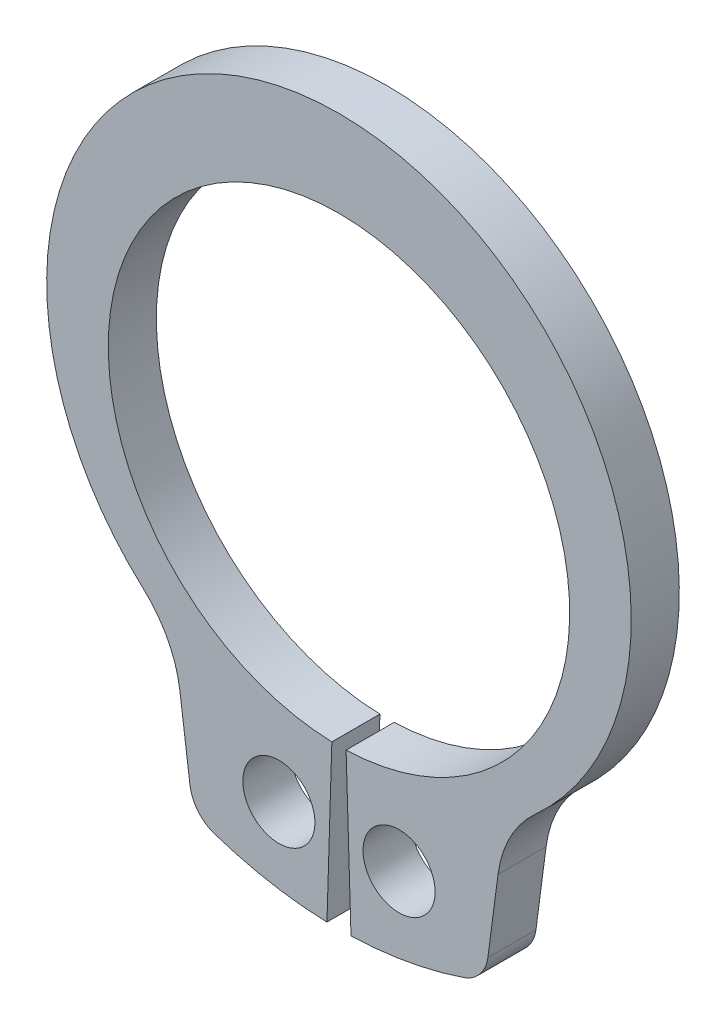
ISO-10303-21;
HEADER;
FILE_DESCRIPTION(('STEP AP214'),'2;1');
FILE_NAME('part.step','',(''),(''),'','','');
FILE_SCHEMA(('AUTOMOTIVE_DESIGN { 1 0 10303 214 1 1 1 1 }'));
ENDSEC;
DATA;
#1=APPLICATION_CONTEXT('core data for automotive mechanical design processes');
#2=APPLICATION_PROTOCOL_DEFINITION('international standard','automotive_design',2000,#1);
#3=PRODUCT_CONTEXT('',#1,'mechanical');
#4=PRODUCT('Part','Part','',(#3));
#5=PRODUCT_RELATED_PRODUCT_CATEGORY('part','',(#4));
#6=PRODUCT_DEFINITION_FORMATION('','',#4);
#7=PRODUCT_DEFINITION_CONTEXT('part definition',#1,'design');
#8=PRODUCT_DEFINITION('design','',#6,#7);
#9=PRODUCT_DEFINITION_SHAPE('','',#8);
#10=(LENGTH_UNIT() NAMED_UNIT(*) SI_UNIT(.MILLI.,.METRE.));
#11=(NAMED_UNIT(*) PLANE_ANGLE_UNIT() SI_UNIT($,.RADIAN.));
#12=(NAMED_UNIT(*) SI_UNIT($,.STERADIAN.) SOLID_ANGLE_UNIT());
#13=UNCERTAINTY_MEASURE_WITH_UNIT(LENGTH_MEASURE(1.E-05),#10,'distance_accuracy_value','');
#14=(GEOMETRIC_REPRESENTATION_CONTEXT(3) GLOBAL_UNCERTAINTY_ASSIGNED_CONTEXT((#13)) GLOBAL_UNIT_ASSIGNED_CONTEXT((#10,
#11,#12)) REPRESENTATION_CONTEXT('',''));
#15=CARTESIAN_POINT('',(0.,0.,0.));
#16=DIRECTION('',(0.,0.,1.));
#17=DIRECTION('',(1.,0.,0.));
#18=AXIS2_PLACEMENT_3D('',#15,#16,#17);
#19=CARTESIAN_POINT('',(0.,0.,-1.));
#20=DIRECTION('',(0.,0.,1.));
#21=DIRECTION('',(1.,0.,0.));
#22=AXIS2_PLACEMENT_3D('',#19,#20,#21);
#23=CYLINDRICAL_SURFACE('',#22,4.8);
#24=CARTESIAN_POINT('',(0.,0.,0.));
#25=DIRECTION('',(0.,0.,-1.));
#26=DIRECTION('',(1.,0.,0.));
#27=AXIS2_PLACEMENT_3D('',#24,#25,#26);
#28=CIRCLE('',#27,4.8);
#29=CARTESIAN_POINT('',(-0.148148148148148,-4.79771321841982,0.));
#30=VERTEX_POINT('',#29);
#31=CARTESIAN_POINT('',(0.148148148148148,-4.79771321841982,0.));
#32=VERTEX_POINT('',#31);
#33=EDGE_CURVE('E154',#30,#32,#28,.T.);
#34=ORIENTED_EDGE('',*,*,#33,.F.);
#35=DIRECTION('',(0.,0.,1.));
#36=VECTOR('',#35,1.);
#37=CARTESIAN_POINT('',(-0.148148148148148,-4.79771321841982,-1.));
#38=LINE('',#37,#36);
#39=CARTESIAN_POINT('',(-0.148148148148148,-4.79771321841982,-1.));
#40=VERTEX_POINT('',#39);
#41=EDGE_CURVE('E11',#40,#30,#38,.T.);
#42=ORIENTED_EDGE('',*,*,#41,.F.);
#43=CARTESIAN_POINT('',(0.,0.,-1.));
#44=DIRECTION('',(0.,0.,-1.));
#45=DIRECTION('',(1.,0.,0.));
#46=AXIS2_PLACEMENT_3D('',#43,#44,#45);
#47=CIRCLE('',#46,4.8);
#48=CARTESIAN_POINT('',(0.148148148148148,-4.79771321841982,-1.));
#49=VERTEX_POINT('',#48);
#50=EDGE_CURVE('E187',#40,#49,#47,.T.);
#51=ORIENTED_EDGE('',*,*,#50,.T.);
#52=DIRECTION('',(0.,0.,1.));
#53=VECTOR('',#52,1.);
#54=CARTESIAN_POINT('',(0.148148148148148,-4.79771321841982,-1.));
#55=LINE('',#54,#53);
#56=EDGE_CURVE('E36',#49,#32,#55,.T.);
#57=ORIENTED_EDGE('',*,*,#56,.T.);
#58=EDGE_LOOP('',(#34,#42,#51,#57));
#59=FACE_BOUND('',#58,.T.);
#60=ADVANCED_FACE('F33',(#59),#23,.F.);
#61=CARTESIAN_POINT('',(-0.148148148148148,-4.79771321841982,-1.));
#62=DIRECTION('',(0.999523587170796,-0.0308641975308642,0.));
#63=DIRECTION('',(0.0308641975308642,0.999523587170796,0.));
#64=AXIS2_PLACEMENT_3D('',#61,#62,#63);
#65=PLANE('',#64);
#66=DIRECTION('',(0.0308641975308642,0.999523587170796,0.));
#67=VECTOR('',#66,1.);
#68=CARTESIAN_POINT('',(-0.148148148148148,-4.79771321841982,0.));
#69=LINE('',#68,#67);
#70=CARTESIAN_POINT('',(-0.25,-8.09614105608345,0.));
#71=VERTEX_POINT('',#70);
#72=EDGE_CURVE('E185',#71,#30,#69,.T.);
#73=ORIENTED_EDGE('',*,*,#72,.F.);
#74=DIRECTION('',(0.,0.,1.));
#75=VECTOR('',#74,1.);
#76=CARTESIAN_POINT('',(-0.25,-8.09614105608345,-1.));
#77=LINE('',#76,#75);
#78=CARTESIAN_POINT('',(-0.25,-8.09614105608345,-1.));
#79=VERTEX_POINT('',#78);
#80=EDGE_CURVE('E42',#79,#71,#77,.T.);
#81=ORIENTED_EDGE('',*,*,#80,.F.);
#82=DIRECTION('',(0.0308641975308642,0.999523587170796,0.));
#83=VECTOR('',#82,1.);
#84=CARTESIAN_POINT('',(-0.148148148148148,-4.79771321841982,-1.));
#85=LINE('',#84,#83);
#86=EDGE_CURVE('E144',#79,#40,#85,.T.);
#87=ORIENTED_EDGE('',*,*,#86,.T.);
#88=ORIENTED_EDGE('',*,*,#41,.T.);
#89=EDGE_LOOP('',(#73,#81,#87,#88));
#90=FACE_BOUND('',#89,.T.);
#91=ADVANCED_FACE('F207',(#90),#65,.T.);
#92=CARTESIAN_POINT('',(0.,0.,-1.));
#93=DIRECTION('',(0.,0.,1.));
#94=DIRECTION('',(1.,0.,0.));
#95=AXIS2_PLACEMENT_3D('',#92,#93,#94);
#96=CYLINDRICAL_SURFACE('',#95,8.1);
#97=CARTESIAN_POINT('',(0.,0.,0.));
#98=DIRECTION('',(0.,0.,1.));
#99=DIRECTION('',(1.,0.,0.));
#100=AXIS2_PLACEMENT_3D('',#97,#98,#99);
#101=CIRCLE('',#100,8.1);
#102=CARTESIAN_POINT('',(-2.59511535496144,-7.67302914724317,0.));
#103=VERTEX_POINT('',#102);
#104=EDGE_CURVE('E131',#103,#71,#101,.T.);
#105=ORIENTED_EDGE('',*,*,#104,.F.);
#106=DIRECTION('',(0.,0.,1.));
#107=VECTOR('',#106,1.);
#108=CARTESIAN_POINT('',(-2.59511535496144,-7.67302914724317,-1.));
#109=LINE('',#108,#107);
#110=CARTESIAN_POINT('',(-2.59511535496144,-7.67302914724317,-1.));
#111=VERTEX_POINT('',#110);
#112=EDGE_CURVE('E126',#111,#103,#109,.T.);
#113=ORIENTED_EDGE('',*,*,#112,.F.);
#114=CARTESIAN_POINT('',(0.,0.,-1.));
#115=DIRECTION('',(0.,0.,1.));
#116=DIRECTION('',(1.,0.,0.));
#117=AXIS2_PLACEMENT_3D('',#114,#115,#116);
#118=CIRCLE('',#117,8.1);
#119=EDGE_CURVE('E129',#111,#79,#118,.T.);
#120=ORIENTED_EDGE('',*,*,#119,.T.);
#121=ORIENTED_EDGE('',*,*,#80,.T.);
#122=EDGE_LOOP('',(#105,#113,#120,#121));
#123=FACE_BOUND('',#122,.T.);
#124=ADVANCED_FACE('F128',(#123),#96,.T.);
#125=CARTESIAN_POINT('',(-2.35482689616871,-6.9625634854614,-1.));
#126=DIRECTION('',(0.,0.,1.));
#127=DIRECTION('',(1.,0.,0.));
#128=AXIS2_PLACEMENT_3D('',#125,#126,#127);
#129=CYLINDRICAL_SURFACE('',#128,0.75);
#130=CARTESIAN_POINT('',(-2.35482689616871,-6.9625634854614,0.));
#131=DIRECTION('',(0.,0.,1.));
#132=DIRECTION('',(1.,0.,0.));
#133=AXIS2_PLACEMENT_3D('',#130,#131,#132);
#134=CIRCLE('',#133,0.75);
#135=CARTESIAN_POINT('',(-3.09841054219907,-7.06045812962644,0.));
#136=VERTEX_POINT('',#135);
#137=EDGE_CURVE('E182',#136,#103,#134,.T.);
#138=ORIENTED_EDGE('',*,*,#137,.F.);
#139=DIRECTION('',(0.,0.,1.));
#140=VECTOR('',#139,1.);
#141=CARTESIAN_POINT('',(-3.09841054219907,-7.06045812962644,-1.));
#142=LINE('',#141,#140);
#143=CARTESIAN_POINT('',(-3.09841054219907,-7.06045812962644,-1.));
#144=VERTEX_POINT('',#143);
#145=EDGE_CURVE('E136',#144,#136,#142,.T.);
#146=ORIENTED_EDGE('',*,*,#145,.F.);
#147=CARTESIAN_POINT('',(-2.35482689616871,-6.9625634854614,-1.));
#148=DIRECTION('',(0.,0.,1.));
#149=DIRECTION('',(1.,0.,0.));
#150=AXIS2_PLACEMENT_3D('',#147,#148,#149);
#151=CIRCLE('',#150,0.75);
#152=EDGE_CURVE('E142',#144,#111,#151,.T.);
#153=ORIENTED_EDGE('',*,*,#152,.T.);
#154=ORIENTED_EDGE('',*,*,#112,.T.);
#155=EDGE_LOOP('',(#138,#146,#153,#154));
#156=FACE_BOUND('',#155,.T.);
#157=ADVANCED_FACE('F146',(#156),#129,.T.);
#158=CARTESIAN_POINT('',(-3.30965181475856,-5.45592136480539,-1.));
#159=DIRECTION('',(-0.99144486137381,-0.130526192220052,0.));
#160=DIRECTION('',(0.130526192220052,-0.99144486137381,0.));
#161=AXIS2_PLACEMENT_3D('',#158,#159,#160);
#162=PLANE('',#161);
#163=DIRECTION('',(0.130526192220052,-0.99144486137381,0.));
#164=VECTOR('',#163,1.);
#165=CARTESIAN_POINT('',(-3.30965181475856,-5.45592136480539,0.));
#166=LINE('',#165,#164);
#167=CARTESIAN_POINT('',(-3.30965181475856,-5.45592136480539,0.));
#168=VERTEX_POINT('',#167);
#169=EDGE_CURVE('E179',#168,#136,#166,.T.);
#170=ORIENTED_EDGE('',*,*,#169,.F.);
#171=DIRECTION('',(0.,0.,1.));
#172=VECTOR('',#171,1.);
#173=CARTESIAN_POINT('',(-3.30965181475856,-5.45592136480539,-1.));
#174=LINE('',#173,#172);
#175=CARTESIAN_POINT('',(-3.30965181475856,-5.45592136480539,-1.));
#176=VERTEX_POINT('',#175);
#177=EDGE_CURVE('E191',#176,#168,#174,.T.);
#178=ORIENTED_EDGE('',*,*,#177,.F.);
#179=DIRECTION('',(0.130526192220052,-0.99144486137381,0.));
#180=VECTOR('',#179,1.);
#181=CARTESIAN_POINT('',(-3.30965181475856,-5.45592136480539,-1.));
#182=LINE('',#181,#180);
#183=EDGE_CURVE('E147',#176,#144,#182,.T.);
#184=ORIENTED_EDGE('',*,*,#183,.T.);
#185=ORIENTED_EDGE('',*,*,#145,.T.);
#186=EDGE_LOOP('',(#170,#178,#184,#185));
#187=FACE_BOUND('',#186,.T.);
#188=ADVANCED_FACE('F220',(#187),#162,.T.);
#189=CARTESIAN_POINT('',(-5.68605087745157,-5.76878023667328,-1.));
#190=DIRECTION('',(0.,0.,1.));
#191=DIRECTION('',(1.,0.,0.));
#192=AXIS2_PLACEMENT_3D('',#189,#190,#191);
#193=CYLINDRICAL_SURFACE('',#192,2.3969049165277);
#194=CARTESIAN_POINT('',(-5.68605087745157,-5.76878023667328,0.));
#195=DIRECTION('',(0.,0.,-1.));
#196=DIRECTION('',(1.,0.,0.));
#197=AXIS2_PLACEMENT_3D('',#194,#195,#196);
#198=CIRCLE('',#197,2.3969049165277);
#199=CARTESIAN_POINT('',(-4.07842108653022,-3.99095020142896,0.));
#200=VERTEX_POINT('',#199);
#201=EDGE_CURVE('E176',#200,#168,#198,.T.);
#202=ORIENTED_EDGE('',*,*,#201,.F.);
#203=DIRECTION('',(0.,0.,1.));
#204=VECTOR('',#203,1.);
#205=CARTESIAN_POINT('',(-4.07842108653022,-3.99095020142896,-1.));
#206=LINE('',#205,#204);
#207=CARTESIAN_POINT('',(-4.07842108653022,-3.99095020142896,-1.));
#208=VERTEX_POINT('',#207);
#209=EDGE_CURVE('E193',#208,#200,#206,.T.);
#210=ORIENTED_EDGE('',*,*,#209,.F.);
#211=CARTESIAN_POINT('',(-5.68605087745157,-5.76878023667328,-1.));
#212=DIRECTION('',(0.,0.,-1.));
#213=DIRECTION('',(1.,0.,0.));
#214=AXIS2_PLACEMENT_3D('',#211,#212,#213);
#215=CIRCLE('',#214,2.3969049165277);
#216=EDGE_CURVE('E149',#208,#176,#215,.T.);
#217=ORIENTED_EDGE('',*,*,#216,.T.);
#218=ORIENTED_EDGE('',*,*,#177,.T.);
#219=EDGE_LOOP('',(#202,#210,#217,#218));
#220=FACE_BOUND('',#219,.T.);
#221=ADVANCED_FACE('F223',(#220),#193,.F.);
#222=CARTESIAN_POINT('',(0.,0.519254539086392,-1.));
#223=DIRECTION('',(0.,0.,1.));
#224=DIRECTION('',(1.,0.,0.));
#225=AXIS2_PLACEMENT_3D('',#222,#223,#224);
#226=CYLINDRICAL_SURFACE('',#225,6.08074546091361);
#227=CARTESIAN_POINT('',(0.,0.519254539086392,0.));
#228=DIRECTION('',(0.,0.,1.));
#229=DIRECTION('',(1.,0.,0.));
#230=AXIS2_PLACEMENT_3D('',#227,#228,#229);
#231=CIRCLE('',#230,6.08074546091361);
#232=CARTESIAN_POINT('',(4.07842108653022,-3.99095020142896,0.));
#233=VERTEX_POINT('',#232);
#234=EDGE_CURVE('E173',#233,#200,#231,.T.);
#235=ORIENTED_EDGE('',*,*,#234,.F.);
#236=DIRECTION('',(0.,0.,1.));
#237=VECTOR('',#236,1.);
#238=CARTESIAN_POINT('',(4.07842108653022,-3.99095020142896,-1.));
#239=LINE('',#238,#237);
#240=CARTESIAN_POINT('',(4.07842108653022,-3.99095020142896,-1.));
#241=VERTEX_POINT('',#240);
#242=EDGE_CURVE('E195',#241,#233,#239,.T.);
#243=ORIENTED_EDGE('',*,*,#242,.F.);
#244=CARTESIAN_POINT('',(0.,0.519254539086392,-1.));
#245=DIRECTION('',(0.,0.,1.));
#246=DIRECTION('',(1.,0.,0.));
#247=AXIS2_PLACEMENT_3D('',#244,#245,#246);
#248=CIRCLE('',#247,6.08074546091361);
#249=EDGE_CURVE('E297',#241,#208,#248,.T.);
#250=ORIENTED_EDGE('',*,*,#249,.T.);
#251=ORIENTED_EDGE('',*,*,#209,.T.);
#252=EDGE_LOOP('',(#235,#243,#250,#251));
#253=FACE_BOUND('',#252,.T.);
#254=ADVANCED_FACE('F227',(#253),#226,.T.);
#255=CARTESIAN_POINT('',(5.68605087745157,-5.76878023667328,-1.));
#256=DIRECTION('',(0.,0.,1.));
#257=DIRECTION('',(1.,0.,0.));
#258=AXIS2_PLACEMENT_3D('',#255,#256,#257);
#259=CYLINDRICAL_SURFACE('',#258,2.3969049165277);
#260=CARTESIAN_POINT('',(5.68605087745157,-5.76878023667328,0.));
#261=DIRECTION('',(0.,0.,-1.));
#262=DIRECTION('',(1.,0.,0.));
#263=AXIS2_PLACEMENT_3D('',#260,#261,#262);
#264=CIRCLE('',#263,2.3969049165277);
#265=CARTESIAN_POINT('',(3.30965181475856,-5.45592136480539,0.));
#266=VERTEX_POINT('',#265);
#267=EDGE_CURVE('E170',#266,#233,#264,.T.);
#268=ORIENTED_EDGE('',*,*,#267,.F.);
#269=DIRECTION('',(0.,0.,1.));
#270=VECTOR('',#269,1.);
#271=CARTESIAN_POINT('',(3.30965181475856,-5.45592136480539,-1.));
#272=LINE('',#271,#270);
#273=CARTESIAN_POINT('',(3.30965181475856,-5.45592136480539,-1.));
#274=VERTEX_POINT('',#273);
#275=EDGE_CURVE('E197',#274,#266,#272,.T.);
#276=ORIENTED_EDGE('',*,*,#275,.F.);
#277=CARTESIAN_POINT('',(5.68605087745157,-5.76878023667328,-1.));
#278=DIRECTION('',(0.,0.,-1.));
#279=DIRECTION('',(1.,0.,0.));
#280=AXIS2_PLACEMENT_3D('',#277,#278,#279);
#281=CIRCLE('',#280,2.3969049165277);
#282=EDGE_CURVE('E294',#274,#241,#281,.T.);
#283=ORIENTED_EDGE('',*,*,#282,.T.);
#284=ORIENTED_EDGE('',*,*,#242,.T.);
#285=EDGE_LOOP('',(#268,#276,#283,#284));
#286=FACE_BOUND('',#285,.T.);
#287=ADVANCED_FACE('F231',(#286),#259,.F.);
#288=CARTESIAN_POINT('',(3.30965181475856,-5.45592136480539,-1.));
#289=DIRECTION('',(0.99144486137381,-0.130526192220052,0.));
#290=DIRECTION('',(0.130526192220052,0.99144486137381,0.));
#291=AXIS2_PLACEMENT_3D('',#288,#289,#290);
#292=PLANE('',#291);
#293=DIRECTION('',(0.130526192220052,0.99144486137381,0.));
#294=VECTOR('',#293,1.);
#295=CARTESIAN_POINT('',(3.30965181475856,-5.45592136480539,0.));
#296=LINE('',#295,#294);
#297=CARTESIAN_POINT('',(3.09841054219907,-7.06045812962644,0.));
#298=VERTEX_POINT('',#297);
#299=EDGE_CURVE('E167',#298,#266,#296,.T.);
#300=ORIENTED_EDGE('',*,*,#299,.F.);
#301=DIRECTION('',(0.,0.,1.));
#302=VECTOR('',#301,1.);
#303=CARTESIAN_POINT('',(3.09841054219907,-7.06045812962644,-1.));
#304=LINE('',#303,#302);
#305=CARTESIAN_POINT('',(3.09841054219907,-7.06045812962644,-1.));
#306=VERTEX_POINT('',#305);
#307=EDGE_CURVE('E199',#306,#298,#304,.T.);
#308=ORIENTED_EDGE('',*,*,#307,.F.);
#309=DIRECTION('',(0.130526192220052,0.99144486137381,0.));
#310=VECTOR('',#309,1.);
#311=CARTESIAN_POINT('',(3.30965181475856,-5.45592136480539,-1.));
#312=LINE('',#311,#310);
#313=EDGE_CURVE('E291',#306,#274,#312,.T.);
#314=ORIENTED_EDGE('',*,*,#313,.T.);
#315=ORIENTED_EDGE('',*,*,#275,.T.);
#316=EDGE_LOOP('',(#300,#308,#314,#315));
#317=FACE_BOUND('',#316,.T.);
#318=ADVANCED_FACE('F235',(#317),#292,.T.);
#319=CARTESIAN_POINT('',(2.35482689616871,-6.9625634854614,-1.));
#320=DIRECTION('',(0.,0.,1.));
#321=DIRECTION('',(1.,0.,0.));
#322=AXIS2_PLACEMENT_3D('',#319,#320,#321);
#323=CYLINDRICAL_SURFACE('',#322,0.75);
#324=CARTESIAN_POINT('',(2.35482689616871,-6.9625634854614,0.));
#325=DIRECTION('',(0.,0.,1.));
#326=DIRECTION('',(-1.,0.,0.));
#327=AXIS2_PLACEMENT_3D('',#324,#325,#326);
#328=CIRCLE('',#327,0.75);
#329=CARTESIAN_POINT('',(2.59511535496144,-7.67302914724318,0.));
#330=VERTEX_POINT('',#329);
#331=EDGE_CURVE('E164',#330,#298,#328,.T.);
#332=ORIENTED_EDGE('',*,*,#331,.F.);
#333=DIRECTION('',(0.,0.,1.));
#334=VECTOR('',#333,1.);
#335=CARTESIAN_POINT('',(2.59511535496144,-7.67302914724318,-1.));
#336=LINE('',#335,#334);
#337=CARTESIAN_POINT('',(2.59511535496144,-7.67302914724318,-1.));
#338=VERTEX_POINT('',#337);
#339=EDGE_CURVE('E201',#338,#330,#336,.T.);
#340=ORIENTED_EDGE('',*,*,#339,.F.);
#341=CARTESIAN_POINT('',(2.35482689616871,-6.9625634854614,-1.));
#342=DIRECTION('',(0.,0.,1.));
#343=DIRECTION('',(-1.,0.,0.));
#344=AXIS2_PLACEMENT_3D('',#341,#342,#343);
#345=CIRCLE('',#344,0.75);
#346=EDGE_CURVE('E288',#338,#306,#345,.T.);
#347=ORIENTED_EDGE('',*,*,#346,.T.);
#348=ORIENTED_EDGE('',*,*,#307,.T.);
#349=EDGE_LOOP('',(#332,#340,#347,#348));
#350=FACE_BOUND('',#349,.T.);
#351=ADVANCED_FACE('F239',(#350),#323,.T.);
#352=CARTESIAN_POINT('',(0.,0.,-1.));
#353=DIRECTION('',(0.,0.,1.));
#354=DIRECTION('',(1.,0.,0.));
#355=AXIS2_PLACEMENT_3D('',#352,#353,#354);
#356=CYLINDRICAL_SURFACE('',#355,8.1);
#357=CARTESIAN_POINT('',(0.,0.,0.));
#358=DIRECTION('',(0.,0.,1.));
#359=DIRECTION('',(1.,0.,0.));
#360=AXIS2_PLACEMENT_3D('',#357,#358,#359);
#361=CIRCLE('',#360,8.1);
#362=CARTESIAN_POINT('',(0.249999999999997,-8.09614105608345,0.));
#363=VERTEX_POINT('',#362);
#364=EDGE_CURVE('E161',#363,#330,#361,.T.);
#365=ORIENTED_EDGE('',*,*,#364,.F.);
#366=DIRECTION('',(0.,0.,1.));
#367=VECTOR('',#366,1.);
#368=CARTESIAN_POINT('',(0.249999999999997,-8.09614105608345,-1.));
#369=LINE('',#368,#367);
#370=CARTESIAN_POINT('',(0.249999999999997,-8.09614105608345,-1.));
#371=VERTEX_POINT('',#370);
#372=EDGE_CURVE('E202',#371,#363,#369,.T.);
#373=ORIENTED_EDGE('',*,*,#372,.F.);
#374=CARTESIAN_POINT('',(0.,0.,-1.));
#375=DIRECTION('',(0.,0.,1.));
#376=DIRECTION('',(1.,0.,0.));
#377=AXIS2_PLACEMENT_3D('',#374,#375,#376);
#378=CIRCLE('',#377,8.1);
#379=EDGE_CURVE('E285',#371,#338,#378,.T.);
#380=ORIENTED_EDGE('',*,*,#379,.T.);
#381=ORIENTED_EDGE('',*,*,#339,.T.);
#382=EDGE_LOOP('',(#365,#373,#380,#381));
#383=FACE_BOUND('',#382,.T.);
#384=ADVANCED_FACE('F243',(#383),#356,.T.);
#385=CARTESIAN_POINT('',(0.148148148148148,-4.79771321841982,-1.));
#386=DIRECTION('',(-0.999523587170796,-0.0308641975308642,0.));
#387=DIRECTION('',(0.0308641975308642,-0.999523587170796,0.));
#388=AXIS2_PLACEMENT_3D('',#385,#386,#387);
#389=PLANE('',#388);
#390=DIRECTION('',(0.0308641975308642,-0.999523587170796,0.));
#391=VECTOR('',#390,1.);
#392=CARTESIAN_POINT('',(0.148148148148148,-4.79771321841982,0.));
#393=LINE('',#392,#391);
#394=EDGE_CURVE('E157',#32,#363,#393,.T.);
#395=ORIENTED_EDGE('',*,*,#394,.F.);
#396=ORIENTED_EDGE('',*,*,#56,.F.);
#397=DIRECTION('',(0.0308641975308642,-0.999523587170796,0.));
#398=VECTOR('',#397,1.);
#399=CARTESIAN_POINT('',(0.148148148148148,-4.79771321841982,-1.));
#400=LINE('',#399,#398);
#401=EDGE_CURVE('E283',#49,#371,#400,.T.);
#402=ORIENTED_EDGE('',*,*,#401,.T.);
#403=ORIENTED_EDGE('',*,*,#372,.T.);
#404=EDGE_LOOP('',(#395,#396,#402,#403));
#405=FACE_BOUND('',#404,.T.);
#406=ADVANCED_FACE('F204',(#405),#389,.T.);
#407=CARTESIAN_POINT('',(0.,0.,-1.));
#408=DIRECTION('',(0.,0.,1.));
#409=DIRECTION('',(1.,0.,0.));
#410=AXIS2_PLACEMENT_3D('',#407,#408,#409);
#411=PLANE('',#410);
#412=CARTESIAN_POINT('',(-1.25,-6.4296189622714,-1.));
#413=DIRECTION('',(0.,0.,1.));
#414=DIRECTION('',(1.,0.,0.));
#415=AXIS2_PLACEMENT_3D('',#412,#413,#414);
#416=CIRCLE('',#415,0.75);
#417=CARTESIAN_POINT('',(-0.5,-6.4296189622714,-1.));
#418=VERTEX_POINT('',#417);
#419=EDGE_CURVE('E270',#418,#418,#416,.T.);
#420=ORIENTED_EDGE('',*,*,#419,.T.);
#421=EDGE_LOOP('',(#420));
#422=FACE_BOUND('',#421,.T.);
#423=CARTESIAN_POINT('',(1.25,-6.4296189622714,-1.));
#424=DIRECTION('',(0.,0.,1.));
#425=DIRECTION('',(1.,0.,0.));
#426=AXIS2_PLACEMENT_3D('',#423,#424,#425);
#427=CIRCLE('',#426,0.75);
#428=CARTESIAN_POINT('',(2.,-6.4296189622714,-1.));
#429=VERTEX_POINT('',#428);
#430=EDGE_CURVE('E158',#429,#429,#427,.T.);
#431=ORIENTED_EDGE('',*,*,#430,.T.);
#432=EDGE_LOOP('',(#431));
#433=FACE_BOUND('',#432,.T.);
#434=ORIENTED_EDGE('',*,*,#50,.F.);
#435=ORIENTED_EDGE('',*,*,#86,.F.);
#436=ORIENTED_EDGE('',*,*,#119,.F.);
#437=ORIENTED_EDGE('',*,*,#152,.F.);
#438=ORIENTED_EDGE('',*,*,#183,.F.);
#439=ORIENTED_EDGE('',*,*,#216,.F.);
#440=ORIENTED_EDGE('',*,*,#249,.F.);
#441=ORIENTED_EDGE('',*,*,#282,.F.);
#442=ORIENTED_EDGE('',*,*,#313,.F.);
#443=ORIENTED_EDGE('',*,*,#346,.F.);
#444=ORIENTED_EDGE('',*,*,#379,.F.);
#445=ORIENTED_EDGE('',*,*,#401,.F.);
#446=EDGE_LOOP('',(#434,#435,#436,#437,#438,#439,#440,#441,#442,#443,#444,#445));
#447=FACE_BOUND('',#446,.T.);
#448=ADVANCED_FACE('F140',(#422,#433,#447),#411,.F.);
#449=CARTESIAN_POINT('',(0.,0.,0.));
#450=DIRECTION('',(0.,0.,1.));
#451=DIRECTION('',(1.,0.,0.));
#452=AXIS2_PLACEMENT_3D('',#449,#450,#451);
#453=PLANE('',#452);
#454=CARTESIAN_POINT('',(-1.25,-6.4296189622714,0.));
#455=DIRECTION('',(0.,0.,1.));
#456=DIRECTION('',(1.,0.,0.));
#457=AXIS2_PLACEMENT_3D('',#454,#455,#456);
#458=CIRCLE('',#457,0.75);
#459=CARTESIAN_POINT('',(-0.5,-6.4296189622714,0.));
#460=VERTEX_POINT('',#459);
#461=EDGE_CURVE('E273',#460,#460,#458,.T.);
#462=ORIENTED_EDGE('',*,*,#461,.F.);
#463=EDGE_LOOP('',(#462));
#464=FACE_BOUND('',#463,.T.);
#465=CARTESIAN_POINT('',(1.25,-6.4296189622714,0.));
#466=DIRECTION('',(0.,0.,1.));
#467=DIRECTION('',(1.,0.,0.));
#468=AXIS2_PLACEMENT_3D('',#465,#466,#467);
#469=CIRCLE('',#468,0.75);
#470=CARTESIAN_POINT('',(2.,-6.4296189622714,0.));
#471=VERTEX_POINT('',#470);
#472=EDGE_CURVE('E275',#471,#471,#469,.T.);
#473=ORIENTED_EDGE('',*,*,#472,.F.);
#474=EDGE_LOOP('',(#473));
#475=FACE_BOUND('',#474,.T.);
#476=ORIENTED_EDGE('',*,*,#33,.T.);
#477=ORIENTED_EDGE('',*,*,#394,.T.);
#478=ORIENTED_EDGE('',*,*,#364,.T.);
#479=ORIENTED_EDGE('',*,*,#331,.T.);
#480=ORIENTED_EDGE('',*,*,#299,.T.);
#481=ORIENTED_EDGE('',*,*,#267,.T.);
#482=ORIENTED_EDGE('',*,*,#234,.T.);
#483=ORIENTED_EDGE('',*,*,#201,.T.);
#484=ORIENTED_EDGE('',*,*,#169,.T.);
#485=ORIENTED_EDGE('',*,*,#137,.T.);
#486=ORIENTED_EDGE('',*,*,#104,.T.);
#487=ORIENTED_EDGE('',*,*,#72,.T.);
#488=EDGE_LOOP('',(#476,#477,#478,#479,#480,#481,#482,#483,#484,#485,#486,#487));
#489=FACE_BOUND('',#488,.T.);
#490=ADVANCED_FACE('F206',(#464,#475,#489),#453,.T.);
#491=CARTESIAN_POINT('',(1.25,-6.4296189622714,-1.));
#492=DIRECTION('',(0.,0.,1.));
#493=DIRECTION('',(1.,0.,0.));
#494=AXIS2_PLACEMENT_3D('',#491,#492,#493);
#495=CYLINDRICAL_SURFACE('',#494,0.75);
#496=ORIENTED_EDGE('',*,*,#430,.F.);
#497=EDGE_LOOP('',(#496));
#498=FACE_BOUND('',#497,.T.);
#499=ORIENTED_EDGE('',*,*,#472,.T.);
#500=EDGE_LOOP('',(#499));
#501=FACE_BOUND('',#500,.T.);
#502=ADVANCED_FACE('F255',(#498,#501),#495,.F.);
#503=CARTESIAN_POINT('',(-1.25,-6.4296189622714,-1.));
#504=DIRECTION('',(0.,0.,1.));
#505=DIRECTION('',(1.,0.,0.));
#506=AXIS2_PLACEMENT_3D('',#503,#504,#505);
#507=CYLINDRICAL_SURFACE('',#506,0.75);
#508=ORIENTED_EDGE('',*,*,#419,.F.);
#509=EDGE_LOOP('',(#508));
#510=FACE_BOUND('',#509,.T.);
#511=ORIENTED_EDGE('',*,*,#461,.T.);
#512=EDGE_LOOP('',(#511));
#513=FACE_BOUND('',#512,.T.);
#514=ADVANCED_FACE('F262',(#510,#513),#507,.F.);
#515=CLOSED_SHELL('',(#60,#91,#124,#157,#188,#221,#254,#287,#318,#351,#384,#406,#448,#490,#502,#514));
#516=MANIFOLD_SOLID_BREP('B2',#515);
#517=ADVANCED_BREP_SHAPE_REPRESENTATION('',(#18,#516),#14);
#518=SHAPE_DEFINITION_REPRESENTATION(#9,#517);
ENDSEC;
END-ISO-10303-21;
